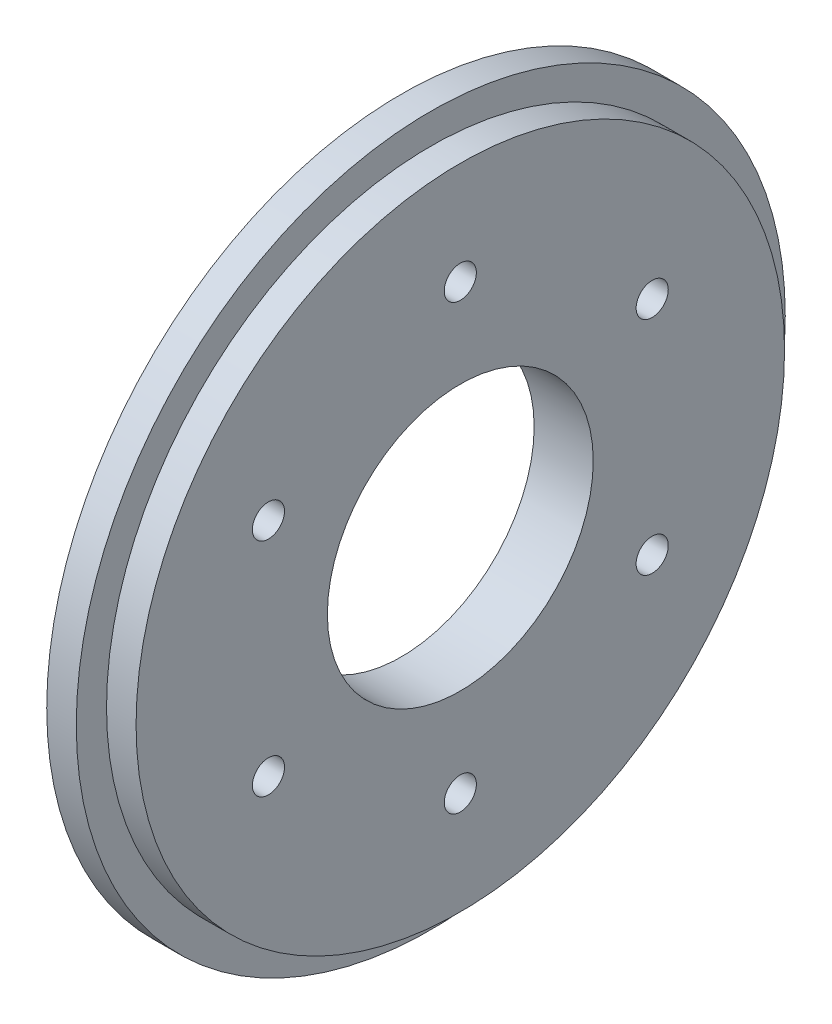
ISO-10303-21;
HEADER;
FILE_DESCRIPTION(('STEP AP214'),'2;1');
FILE_NAME('part.step','',(''),(''),'','','');
FILE_SCHEMA(('AUTOMOTIVE_DESIGN { 1 0 10303 214 1 1 1 1 }'));
ENDSEC;
DATA;
#1=APPLICATION_CONTEXT('core data for automotive mechanical design processes');
#2=APPLICATION_PROTOCOL_DEFINITION('international standard','automotive_design',2000,#1);
#3=PRODUCT_CONTEXT('',#1,'mechanical');
#4=PRODUCT('Part','Part','',(#3));
#5=PRODUCT_RELATED_PRODUCT_CATEGORY('part','',(#4));
#6=PRODUCT_DEFINITION_FORMATION('','',#4);
#7=PRODUCT_DEFINITION_CONTEXT('part definition',#1,'design');
#8=PRODUCT_DEFINITION('design','',#6,#7);
#9=PRODUCT_DEFINITION_SHAPE('','',#8);
#10=(LENGTH_UNIT() NAMED_UNIT(*) SI_UNIT(.MILLI.,.METRE.));
#11=(NAMED_UNIT(*) PLANE_ANGLE_UNIT() SI_UNIT($,.RADIAN.));
#12=(NAMED_UNIT(*) SI_UNIT($,.STERADIAN.) SOLID_ANGLE_UNIT());
#13=UNCERTAINTY_MEASURE_WITH_UNIT(LENGTH_MEASURE(1.E-05),#10,'distance_accuracy_value','');
#14=(GEOMETRIC_REPRESENTATION_CONTEXT(3) GLOBAL_UNCERTAINTY_ASSIGNED_CONTEXT((#13)) GLOBAL_UNIT_ASSIGNED_CONTEXT((#10,
#11,#12)) REPRESENTATION_CONTEXT('',''));
#15=CARTESIAN_POINT('',(0.,0.,0.));
#16=DIRECTION('',(0.,0.,1.));
#17=DIRECTION('',(1.,0.,0.));
#18=AXIS2_PLACEMENT_3D('',#15,#16,#17);
#19=CARTESIAN_POINT('',(6.35,0.,0.));
#20=DIRECTION('',(-1.,0.,0.));
#21=DIRECTION('',(0.,0.,1.));
#22=AXIS2_PLACEMENT_3D('',#19,#20,#21);
#23=CYLINDRICAL_SURFACE('',#22,38.1);
#24=CARTESIAN_POINT('',(0.,0.,0.));
#25=DIRECTION('',(1.,0.,0.));
#26=DIRECTION('',(0.,0.,-1.));
#27=AXIS2_PLACEMENT_3D('',#24,#25,#26);
#28=CIRCLE('',#27,38.1);
#29=CARTESIAN_POINT('',(0.,0.,-38.1));
#30=VERTEX_POINT('',#29);
#31=EDGE_CURVE('E11',#30,#30,#28,.T.);
#32=ORIENTED_EDGE('',*,*,#31,.T.);
#33=EDGE_LOOP('',(#32));
#34=FACE_BOUND('',#33,.T.);
#35=CARTESIAN_POINT('',(3.175,0.,0.));
#36=DIRECTION('',(1.,0.,0.));
#37=DIRECTION('',(0.,0.,-1.));
#38=AXIS2_PLACEMENT_3D('',#35,#36,#37);
#39=CIRCLE('',#38,38.1);
#40=CARTESIAN_POINT('',(3.175,0.,-38.1));
#41=VERTEX_POINT('',#40);
#42=EDGE_CURVE('E45',#41,#41,#39,.T.);
#43=ORIENTED_EDGE('',*,*,#42,.F.);
#44=EDGE_LOOP('',(#43));
#45=FACE_BOUND('',#44,.T.);
#46=ADVANCED_FACE('F39',(#34,#45),#23,.T.);
#47=CARTESIAN_POINT('',(0.,0.,0.));
#48=DIRECTION('',(1.,0.,0.));
#49=DIRECTION('',(0.,0.,-1.));
#50=AXIS2_PLACEMENT_3D('',#47,#48,#49);
#51=PLANE('',#50);
#52=CARTESIAN_POINT('',(0.,-11.9062500000001,20.6222299276169));
#53=DIRECTION('',(-1.,0.,0.));
#54=DIRECTION('',(0.,-0.866025403784436,-0.500000000000004));
#55=AXIS2_PLACEMENT_3D('',#52,#53,#54);
#56=CIRCLE('',#55,1.7272);
#57=CARTESIAN_POINT('',(0.,-13.4020490774166,19.7586299276169));
#58=VERTEX_POINT('',#57);
#59=EDGE_CURVE('E76',#58,#58,#56,.T.);
#60=ORIENTED_EDGE('',*,*,#59,.F.);
#61=EDGE_LOOP('',(#60));
#62=FACE_BOUND('',#61,.T.);
#63=CARTESIAN_POINT('',(0.,-23.8125,0.));
#64=DIRECTION('',(-1.,0.,0.));
#65=DIRECTION('',(0.,0.,-1.));
#66=AXIS2_PLACEMENT_3D('',#63,#64,#65);
#67=CIRCLE('',#66,1.7272);
#68=CARTESIAN_POINT('',(0.,-23.8125,-1.7272));
#69=VERTEX_POINT('',#68);
#70=EDGE_CURVE('E90',#69,#69,#67,.T.);
#71=ORIENTED_EDGE('',*,*,#70,.F.);
#72=EDGE_LOOP('',(#71));
#73=FACE_BOUND('',#72,.T.);
#74=CARTESIAN_POINT('',(0.,-11.9062499999998,-20.6222299276171));
#75=DIRECTION('',(-1.,0.,0.));
#76=DIRECTION('',(0.,0.866025403784443,-0.499999999999992));
#77=AXIS2_PLACEMENT_3D('',#74,#75,#76);
#78=CIRCLE('',#77,1.7272);
#79=CARTESIAN_POINT('',(0.,-10.4104509225833,-21.485829927617));
#80=VERTEX_POINT('',#79);
#81=EDGE_CURVE('E84',#80,#80,#78,.T.);
#82=ORIENTED_EDGE('',*,*,#81,.F.);
#83=EDGE_LOOP('',(#82));
#84=FACE_BOUND('',#83,.T.);
#85=CARTESIAN_POINT('',(0.,11.9062500000002,-20.6222299276168));
#86=DIRECTION('',(-1.,0.,0.));
#87=DIRECTION('',(0.,0.866025403784433,0.50000000000001));
#88=AXIS2_PLACEMENT_3D('',#85,#86,#87);
#89=CIRCLE('',#88,1.7272);
#90=CARTESIAN_POINT('',(0.,13.4020490774167,-19.7586299276168));
#91=VERTEX_POINT('',#90);
#92=EDGE_CURVE('E77',#91,#91,#89,.T.);
#93=ORIENTED_EDGE('',*,*,#92,.F.);
#94=EDGE_LOOP('',(#93));
#95=FACE_BOUND('',#94,.T.);
#96=CARTESIAN_POINT('',(0.,11.90625,20.622229927617));
#97=DIRECTION('',(-1.,0.,0.));
#98=DIRECTION('',(0.,-0.86602540378444,0.499999999999998));
#99=AXIS2_PLACEMENT_3D('',#96,#97,#98);
#100=CIRCLE('',#99,1.7272);
#101=CARTESIAN_POINT('',(0.,10.4104509225835,21.485829927617));
#102=VERTEX_POINT('',#101);
#103=EDGE_CURVE('E70',#102,#102,#100,.T.);
#104=ORIENTED_EDGE('',*,*,#103,.F.);
#105=EDGE_LOOP('',(#104));
#106=FACE_BOUND('',#105,.T.);
#107=CARTESIAN_POINT('',(0.,23.8125,0.));
#108=DIRECTION('',(-1.,0.,0.));
#109=DIRECTION('',(0.,0.,1.));
#110=AXIS2_PLACEMENT_3D('',#107,#108,#109);
#111=CIRCLE('',#110,1.7272);
#112=CARTESIAN_POINT('',(0.,23.8125,1.7272));
#113=VERTEX_POINT('',#112);
#114=EDGE_CURVE('E67',#113,#113,#111,.T.);
#115=ORIENTED_EDGE('',*,*,#114,.F.);
#116=EDGE_LOOP('',(#115));
#117=FACE_BOUND('',#116,.T.);
#118=CARTESIAN_POINT('',(0.,0.,0.));
#119=DIRECTION('',(1.,0.,0.));
#120=DIRECTION('',(0.,0.,-1.));
#121=AXIS2_PLACEMENT_3D('',#118,#119,#120);
#122=CIRCLE('',#121,14.2875);
#123=CARTESIAN_POINT('',(0.,0.,-14.2875));
#124=VERTEX_POINT('',#123);
#125=EDGE_CURVE('E57',#124,#124,#122,.T.);
#126=ORIENTED_EDGE('',*,*,#125,.T.);
#127=EDGE_LOOP('',(#126));
#128=FACE_BOUND('',#127,.T.);
#129=ORIENTED_EDGE('',*,*,#31,.F.);
#130=EDGE_LOOP('',(#129));
#131=FACE_BOUND('',#130,.T.);
#132=ADVANCED_FACE('F111',(#62,#73,#84,#95,#106,#117,#128,#131),#51,.F.);
#133=CARTESIAN_POINT('',(3.175,0.,0.));
#134=DIRECTION('',(1.,0.,0.));
#135=DIRECTION('',(0.,0.,-1.));
#136=AXIS2_PLACEMENT_3D('',#133,#134,#135);
#137=PLANE('',#136);
#138=CARTESIAN_POINT('',(3.175,0.,0.));
#139=DIRECTION('',(1.,0.,0.));
#140=DIRECTION('',(0.,0.,-1.));
#141=AXIS2_PLACEMENT_3D('',#138,#139,#140);
#142=CIRCLE('',#141,34.8488);
#143=CARTESIAN_POINT('',(3.175,0.,-34.8488));
#144=VERTEX_POINT('',#143);
#145=EDGE_CURVE('E49',#144,#144,#142,.T.);
#146=ORIENTED_EDGE('',*,*,#145,.F.);
#147=EDGE_LOOP('',(#146));
#148=FACE_BOUND('',#147,.T.);
#149=ORIENTED_EDGE('',*,*,#42,.T.);
#150=EDGE_LOOP('',(#149));
#151=FACE_BOUND('',#150,.T.);
#152=ADVANCED_FACE('F114',(#148,#151),#137,.T.);
#153=CARTESIAN_POINT('',(3.175,0.,0.));
#154=DIRECTION('',(1.,0.,0.));
#155=DIRECTION('',(0.,0.,-1.));
#156=AXIS2_PLACEMENT_3D('',#153,#154,#155);
#157=CYLINDRICAL_SURFACE('',#156,34.8488);
#158=ORIENTED_EDGE('',*,*,#145,.T.);
#159=EDGE_LOOP('',(#158));
#160=FACE_BOUND('',#159,.T.);
#161=CARTESIAN_POINT('',(6.35,0.,0.));
#162=DIRECTION('',(1.,0.,0.));
#163=DIRECTION('',(0.,0.,-1.));
#164=AXIS2_PLACEMENT_3D('',#161,#162,#163);
#165=CIRCLE('',#164,34.8488);
#166=CARTESIAN_POINT('',(6.35,0.,-34.8488));
#167=VERTEX_POINT('',#166);
#168=EDGE_CURVE('E53',#167,#167,#165,.T.);
#169=ORIENTED_EDGE('',*,*,#168,.F.);
#170=EDGE_LOOP('',(#169));
#171=FACE_BOUND('',#170,.T.);
#172=ADVANCED_FACE('F137',(#160,#171),#157,.T.);
#173=CARTESIAN_POINT('',(6.35,0.,0.));
#174=DIRECTION('',(1.,0.,0.));
#175=DIRECTION('',(0.,0.,-1.));
#176=AXIS2_PLACEMENT_3D('',#173,#174,#175);
#177=PLANE('',#176);
#178=CARTESIAN_POINT('',(6.35,-11.9062500000001,20.6222299276169));
#179=DIRECTION('',(-1.,0.,0.));
#180=DIRECTION('',(0.,-0.866025403784436,-0.500000000000004));
#181=AXIS2_PLACEMENT_3D('',#178,#179,#180);
#182=CIRCLE('',#181,1.7272);
#183=CARTESIAN_POINT('',(6.35,-13.4020490774166,19.7586299276169));
#184=VERTEX_POINT('',#183);
#185=EDGE_CURVE('E93',#184,#184,#182,.T.);
#186=ORIENTED_EDGE('',*,*,#185,.T.);
#187=EDGE_LOOP('',(#186));
#188=FACE_BOUND('',#187,.T.);
#189=CARTESIAN_POINT('',(6.35,-23.8125,0.));
#190=DIRECTION('',(-1.,0.,0.));
#191=DIRECTION('',(0.,0.,-1.));
#192=AXIS2_PLACEMENT_3D('',#189,#190,#191);
#193=CIRCLE('',#192,1.7272);
#194=CARTESIAN_POINT('',(6.35,-23.8125,-1.7272));
#195=VERTEX_POINT('',#194);
#196=EDGE_CURVE('E87',#195,#195,#193,.T.);
#197=ORIENTED_EDGE('',*,*,#196,.T.);
#198=EDGE_LOOP('',(#197));
#199=FACE_BOUND('',#198,.T.);
#200=CARTESIAN_POINT('',(6.35,-11.9062499999998,-20.6222299276171));
#201=DIRECTION('',(-1.,0.,0.));
#202=DIRECTION('',(0.,0.866025403784443,-0.499999999999992));
#203=AXIS2_PLACEMENT_3D('',#200,#201,#202);
#204=CIRCLE('',#203,1.7272);
#205=CARTESIAN_POINT('',(6.35,-10.4104509225833,-21.485829927617));
#206=VERTEX_POINT('',#205);
#207=EDGE_CURVE('E80',#206,#206,#204,.T.);
#208=ORIENTED_EDGE('',*,*,#207,.T.);
#209=EDGE_LOOP('',(#208));
#210=FACE_BOUND('',#209,.T.);
#211=CARTESIAN_POINT('',(6.35,11.9062500000002,-20.6222299276168));
#212=DIRECTION('',(-1.,0.,0.));
#213=DIRECTION('',(0.,0.866025403784433,0.50000000000001));
#214=AXIS2_PLACEMENT_3D('',#211,#212,#213);
#215=CIRCLE('',#214,1.7272);
#216=CARTESIAN_POINT('',(6.35,13.4020490774167,-19.7586299276168));
#217=VERTEX_POINT('',#216);
#218=EDGE_CURVE('E81',#217,#217,#215,.T.);
#219=ORIENTED_EDGE('',*,*,#218,.T.);
#220=EDGE_LOOP('',(#219));
#221=FACE_BOUND('',#220,.T.);
#222=CARTESIAN_POINT('',(6.35,11.90625,20.622229927617));
#223=DIRECTION('',(-1.,0.,0.));
#224=DIRECTION('',(0.,-0.86602540378444,0.499999999999998));
#225=AXIS2_PLACEMENT_3D('',#222,#223,#224);
#226=CIRCLE('',#225,1.7272);
#227=CARTESIAN_POINT('',(6.35,10.4104509225835,21.485829927617));
#228=VERTEX_POINT('',#227);
#229=EDGE_CURVE('E73',#228,#228,#226,.T.);
#230=ORIENTED_EDGE('',*,*,#229,.T.);
#231=EDGE_LOOP('',(#230));
#232=FACE_BOUND('',#231,.T.);
#233=CARTESIAN_POINT('',(6.35,23.8125,0.));
#234=DIRECTION('',(-1.,0.,0.));
#235=DIRECTION('',(0.,0.,1.));
#236=AXIS2_PLACEMENT_3D('',#233,#234,#235);
#237=CIRCLE('',#236,1.7272);
#238=CARTESIAN_POINT('',(6.35,23.8125,1.7272));
#239=VERTEX_POINT('',#238);
#240=EDGE_CURVE('E64',#239,#239,#237,.T.);
#241=ORIENTED_EDGE('',*,*,#240,.T.);
#242=EDGE_LOOP('',(#241));
#243=FACE_BOUND('',#242,.T.);
#244=CARTESIAN_POINT('',(6.35,0.,0.));
#245=DIRECTION('',(1.,0.,0.));
#246=DIRECTION('',(0.,0.,-1.));
#247=AXIS2_PLACEMENT_3D('',#244,#245,#246);
#248=CIRCLE('',#247,14.2875);
#249=CARTESIAN_POINT('',(6.35,0.,-14.2875));
#250=VERTEX_POINT('',#249);
#251=EDGE_CURVE('E61',#250,#250,#248,.T.);
#252=ORIENTED_EDGE('',*,*,#251,.F.);
#253=EDGE_LOOP('',(#252));
#254=FACE_BOUND('',#253,.T.);
#255=ORIENTED_EDGE('',*,*,#168,.T.);
#256=EDGE_LOOP('',(#255));
#257=FACE_BOUND('',#256,.T.);
#258=ADVANCED_FACE('F101',(#188,#199,#210,#221,#232,#243,#254,#257),#177,.T.);
#259=CARTESIAN_POINT('',(6.35,0.,0.));
#260=DIRECTION('',(1.,0.,0.));
#261=DIRECTION('',(0.,0.,-1.));
#262=AXIS2_PLACEMENT_3D('',#259,#260,#261);
#263=CYLINDRICAL_SURFACE('',#262,14.2875);
#264=ORIENTED_EDGE('',*,*,#125,.F.);
#265=EDGE_LOOP('',(#264));
#266=FACE_BOUND('',#265,.T.);
#267=ORIENTED_EDGE('',*,*,#251,.T.);
#268=EDGE_LOOP('',(#267));
#269=FACE_BOUND('',#268,.T.);
#270=ADVANCED_FACE('F128',(#266,#269),#263,.F.);
#271=CARTESIAN_POINT('',(0.,23.8125,0.));
#272=DIRECTION('',(-1.,0.,0.));
#273=DIRECTION('',(0.,0.,1.));
#274=AXIS2_PLACEMENT_3D('',#271,#272,#273);
#275=CYLINDRICAL_SURFACE('',#274,1.7272);
#276=ORIENTED_EDGE('',*,*,#240,.F.);
#277=EDGE_LOOP('',(#276));
#278=FACE_BOUND('',#277,.T.);
#279=ORIENTED_EDGE('',*,*,#114,.T.);
#280=EDGE_LOOP('',(#279));
#281=FACE_BOUND('',#280,.T.);
#282=ADVANCED_FACE('F131',(#278,#281),#275,.F.);
#283=CARTESIAN_POINT('',(0.,11.90625,20.622229927617));
#284=DIRECTION('',(-1.,0.,0.));
#285=DIRECTION('',(0.,-0.86602540378444,0.499999999999998));
#286=AXIS2_PLACEMENT_3D('',#283,#284,#285);
#287=CYLINDRICAL_SURFACE('',#286,1.7272);
#288=ORIENTED_EDGE('',*,*,#229,.F.);
#289=EDGE_LOOP('',(#288));
#290=FACE_BOUND('',#289,.T.);
#291=ORIENTED_EDGE('',*,*,#103,.T.);
#292=EDGE_LOOP('',(#291));
#293=FACE_BOUND('',#292,.T.);
#294=ADVANCED_FACE('F181',(#290,#293),#287,.F.);
#295=CARTESIAN_POINT('',(0.,11.9062500000002,-20.6222299276168));
#296=DIRECTION('',(-1.,0.,0.));
#297=DIRECTION('',(0.,0.866025403784433,0.50000000000001));
#298=AXIS2_PLACEMENT_3D('',#295,#296,#297);
#299=CYLINDRICAL_SURFACE('',#298,1.7272);
#300=ORIENTED_EDGE('',*,*,#218,.F.);
#301=EDGE_LOOP('',(#300));
#302=FACE_BOUND('',#301,.T.);
#303=ORIENTED_EDGE('',*,*,#92,.T.);
#304=EDGE_LOOP('',(#303));
#305=FACE_BOUND('',#304,.T.);
#306=ADVANCED_FACE('F196',(#302,#305),#299,.F.);
#307=CARTESIAN_POINT('',(0.,-11.9062499999998,-20.6222299276171));
#308=DIRECTION('',(-1.,0.,0.));
#309=DIRECTION('',(0.,0.866025403784443,-0.499999999999992));
#310=AXIS2_PLACEMENT_3D('',#307,#308,#309);
#311=CYLINDRICAL_SURFACE('',#310,1.7272);
#312=ORIENTED_EDGE('',*,*,#207,.F.);
#313=EDGE_LOOP('',(#312));
#314=FACE_BOUND('',#313,.T.);
#315=ORIENTED_EDGE('',*,*,#81,.T.);
#316=EDGE_LOOP('',(#315));
#317=FACE_BOUND('',#316,.T.);
#318=ADVANCED_FACE('F191',(#314,#317),#311,.F.);
#319=CARTESIAN_POINT('',(0.,-23.8125,0.));
#320=DIRECTION('',(-1.,0.,0.));
#321=DIRECTION('',(0.,0.,-1.));
#322=AXIS2_PLACEMENT_3D('',#319,#320,#321);
#323=CYLINDRICAL_SURFACE('',#322,1.7272);
#324=ORIENTED_EDGE('',*,*,#196,.F.);
#325=EDGE_LOOP('',(#324));
#326=FACE_BOUND('',#325,.T.);
#327=ORIENTED_EDGE('',*,*,#70,.T.);
#328=EDGE_LOOP('',(#327));
#329=FACE_BOUND('',#328,.T.);
#330=ADVANCED_FACE('F107',(#326,#329),#323,.F.);
#331=CARTESIAN_POINT('',(0.,-11.9062500000001,20.6222299276169));
#332=DIRECTION('',(-1.,0.,0.));
#333=DIRECTION('',(0.,-0.866025403784436,-0.500000000000004));
#334=AXIS2_PLACEMENT_3D('',#331,#332,#333);
#335=CYLINDRICAL_SURFACE('',#334,1.7272);
#336=ORIENTED_EDGE('',*,*,#185,.F.);
#337=EDGE_LOOP('',(#336));
#338=FACE_BOUND('',#337,.T.);
#339=ORIENTED_EDGE('',*,*,#59,.T.);
#340=EDGE_LOOP('',(#339));
#341=FACE_BOUND('',#340,.T.);
#342=ADVANCED_FACE('F104',(#338,#341),#335,.F.);
#343=CLOSED_SHELL('',(#46,#132,#152,#172,#258,#270,#282,#294,#306,#318,#330,#342));
#344=MANIFOLD_SOLID_BREP('B2',#343);
#345=ADVANCED_BREP_SHAPE_REPRESENTATION('',(#18,#344),#14);
#346=SHAPE_DEFINITION_REPRESENTATION(#9,#345);
ENDSEC;
END-ISO-10303-21;
